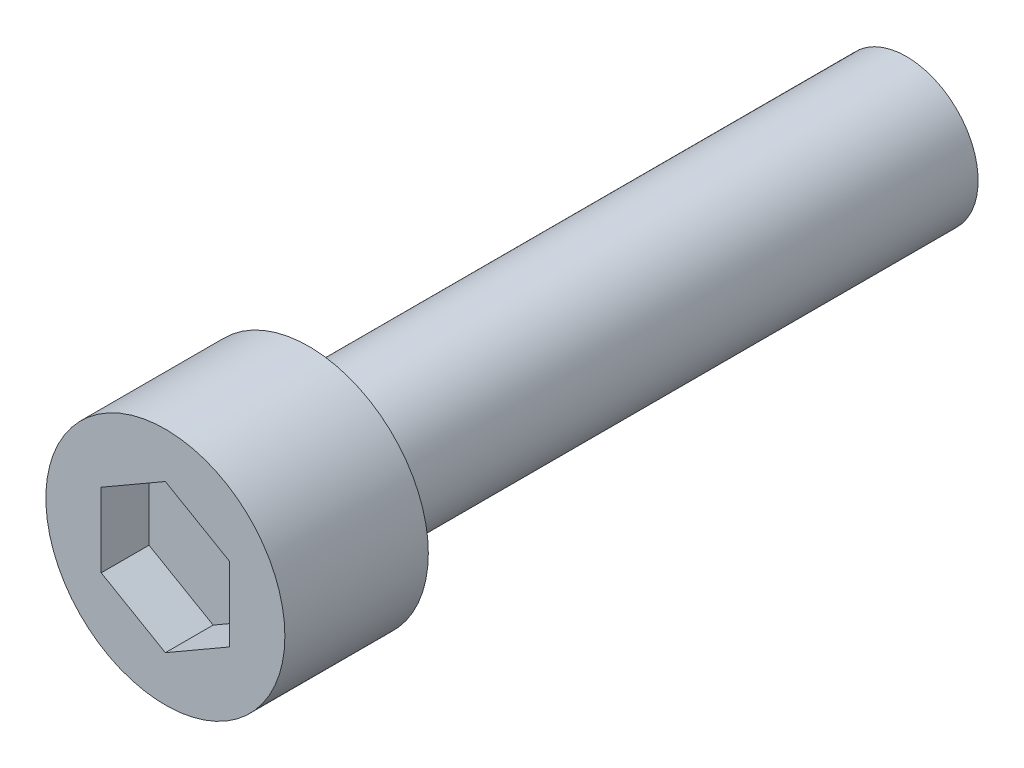
ISO-10303-21;
HEADER;
FILE_DESCRIPTION(('STEP AP214'),'2;1');
FILE_NAME('part.step','',(''),(''),'','','');
FILE_SCHEMA(('AUTOMOTIVE_DESIGN { 1 0 10303 214 1 1 1 1 }'));
ENDSEC;
DATA;
#1=APPLICATION_CONTEXT('core data for automotive mechanical design processes');
#2=APPLICATION_PROTOCOL_DEFINITION('international standard','automotive_design',2000,#1);
#3=PRODUCT_CONTEXT('',#1,'mechanical');
#4=PRODUCT('Part','Part','',(#3));
#5=PRODUCT_RELATED_PRODUCT_CATEGORY('part','',(#4));
#6=PRODUCT_DEFINITION_FORMATION('','',#4);
#7=PRODUCT_DEFINITION_CONTEXT('part definition',#1,'design');
#8=PRODUCT_DEFINITION('design','',#6,#7);
#9=PRODUCT_DEFINITION_SHAPE('','',#8);
#10=(LENGTH_UNIT() NAMED_UNIT(*) SI_UNIT(.MILLI.,.METRE.));
#11=(NAMED_UNIT(*) PLANE_ANGLE_UNIT() SI_UNIT($,.RADIAN.));
#12=(NAMED_UNIT(*) SI_UNIT($,.STERADIAN.) SOLID_ANGLE_UNIT());
#13=UNCERTAINTY_MEASURE_WITH_UNIT(LENGTH_MEASURE(1.E-05),#10,'distance_accuracy_value','');
#14=(GEOMETRIC_REPRESENTATION_CONTEXT(3) GLOBAL_UNCERTAINTY_ASSIGNED_CONTEXT((#13)) GLOBAL_UNIT_ASSIGNED_CONTEXT((#10,
#11,#12)) REPRESENTATION_CONTEXT('',''));
#15=CARTESIAN_POINT('',(0.,0.,0.));
#16=DIRECTION('',(0.,0.,1.));
#17=DIRECTION('',(1.,0.,0.));
#18=AXIS2_PLACEMENT_3D('',#15,#16,#17);
#19=CARTESIAN_POINT('',(0.,0.,4.));
#20=DIRECTION('',(0.,0.,1.));
#21=DIRECTION('',(1.,0.,0.));
#22=AXIS2_PLACEMENT_3D('',#19,#20,#21);
#23=PLANE('',#22);
#24=DIRECTION('',(0.866025403784439,0.5,0.));
#25=VECTOR('',#24,1.);
#26=CARTESIAN_POINT('',(2.68516980116154,-1.55028350752047,4.));
#27=LINE('',#26,#25);
#28=CARTESIAN_POINT('',(0.,-3.10056701504094,4.));
#29=VERTEX_POINT('',#28);
#30=CARTESIAN_POINT('',(2.68516980116154,-1.55028350752047,4.));
#31=VERTEX_POINT('',#30);
#32=EDGE_CURVE('E135',#29,#31,#27,.T.);
#33=ORIENTED_EDGE('',*,*,#32,.T.);
#34=DIRECTION('',(0.,1.,0.));
#35=VECTOR('',#34,1.);
#36=CARTESIAN_POINT('',(2.68516980116154,1.55028350752047,4.));
#37=LINE('',#36,#35);
#38=CARTESIAN_POINT('',(2.68516980116154,1.55028350752047,4.));
#39=VERTEX_POINT('',#38);
#40=EDGE_CURVE('E67',#31,#39,#37,.T.);
#41=ORIENTED_EDGE('',*,*,#40,.T.);
#42=DIRECTION('',(-0.866025403784439,0.5,0.));
#43=VECTOR('',#42,1.);
#44=CARTESIAN_POINT('',(0.,3.10056701504094,4.));
#45=LINE('',#44,#43);
#46=CARTESIAN_POINT('',(0.,3.10056701504094,4.));
#47=VERTEX_POINT('',#46);
#48=EDGE_CURVE('E69',#39,#47,#45,.T.);
#49=ORIENTED_EDGE('',*,*,#48,.T.);
#50=DIRECTION('',(-0.866025403784439,-0.5,0.));
#51=VECTOR('',#50,1.);
#52=CARTESIAN_POINT('',(-2.68516980116154,1.55028350752047,4.));
#53=LINE('',#52,#51);
#54=CARTESIAN_POINT('',(-2.68516980116154,1.55028350752047,4.));
#55=VERTEX_POINT('',#54);
#56=EDGE_CURVE('E71',#47,#55,#53,.T.);
#57=ORIENTED_EDGE('',*,*,#56,.T.);
#58=DIRECTION('',(0.,-1.,0.));
#59=VECTOR('',#58,1.);
#60=CARTESIAN_POINT('',(-2.68516980116154,-1.55028350752047,4.));
#61=LINE('',#60,#59);
#62=CARTESIAN_POINT('',(-2.68516980116154,-1.55028350752047,4.));
#63=VERTEX_POINT('',#62);
#64=EDGE_CURVE('E126',#55,#63,#61,.T.);
#65=ORIENTED_EDGE('',*,*,#64,.T.);
#66=DIRECTION('',(0.866025403784439,-0.5,0.));
#67=VECTOR('',#66,1.);
#68=CARTESIAN_POINT('',(0.,-3.10056701504094,4.));
#69=LINE('',#68,#67);
#70=EDGE_CURVE('E131',#63,#29,#69,.T.);
#71=ORIENTED_EDGE('',*,*,#70,.T.);
#72=EDGE_LOOP('',(#33,#41,#49,#57,#65,#71));
#73=FACE_BOUND('',#72,.T.);
#74=ADVANCED_FACE('F16',(#73),#23,.T.);
#75=CARTESIAN_POINT('',(-2.68516980116154,1.55028350752047,6.));
#76=DIRECTION('',(-0.5,0.866025403784439,0.));
#77=DIRECTION('',(-0.866025403784439,-0.5,0.));
#78=AXIS2_PLACEMENT_3D('',#75,#76,#77);
#79=PLANE('',#78);
#80=DIRECTION('',(0.,0.,1.));
#81=VECTOR('',#80,1.);
#82=CARTESIAN_POINT('',(-2.68516980116154,1.55028350752047,6.));
#83=LINE('',#82,#81);
#84=CARTESIAN_POINT('',(-2.68516980116154,1.55028350752047,6.));
#85=VERTEX_POINT('',#84);
#86=EDGE_CURVE('E82',#85,#55,#83,.F.);
#87=ORIENTED_EDGE('',*,*,#86,.T.);
#88=ORIENTED_EDGE('',*,*,#56,.F.);
#89=DIRECTION('',(0.,0.,1.));
#90=VECTOR('',#89,1.);
#91=CARTESIAN_POINT('',(0.,3.10056701504094,6.));
#92=LINE('',#91,#90);
#93=CARTESIAN_POINT('',(0.,3.10056701504094,6.));
#94=VERTEX_POINT('',#93);
#95=EDGE_CURVE('E76',#47,#94,#92,.T.);
#96=ORIENTED_EDGE('',*,*,#95,.T.);
#97=DIRECTION('',(0.866025403784438,0.5,0.));
#98=VECTOR('',#97,1.);
#99=CARTESIAN_POINT('',(-2.68516980116154,1.55028350752047,6.));
#100=LINE('',#99,#98);
#101=EDGE_CURVE('E123',#85,#94,#100,.T.);
#102=ORIENTED_EDGE('',*,*,#101,.F.);
#103=EDGE_LOOP('',(#87,#88,#96,#102));
#104=FACE_BOUND('',#103,.T.);
#105=ADVANCED_FACE('F79',(#104),#79,.F.);
#106=CARTESIAN_POINT('',(0.,3.10056701504094,6.));
#107=DIRECTION('',(0.5,0.866025403784439,0.));
#108=DIRECTION('',(-0.866025403784439,0.5,0.));
#109=AXIS2_PLACEMENT_3D('',#106,#107,#108);
#110=PLANE('',#109);
#111=ORIENTED_EDGE('',*,*,#95,.F.);
#112=ORIENTED_EDGE('',*,*,#48,.F.);
#113=DIRECTION('',(0.,0.,-1.));
#114=VECTOR('',#113,1.);
#115=CARTESIAN_POINT('',(2.68516980116154,1.55028350752047,6.));
#116=LINE('',#115,#114);
#117=CARTESIAN_POINT('',(2.68516980116154,1.55028350752047,6.));
#118=VERTEX_POINT('',#117);
#119=EDGE_CURVE('E90',#39,#118,#116,.F.);
#120=ORIENTED_EDGE('',*,*,#119,.T.);
#121=DIRECTION('',(0.866025403784438,-0.5,0.));
#122=VECTOR('',#121,1.);
#123=CARTESIAN_POINT('',(0.,3.10056701504094,6.));
#124=LINE('',#123,#122);
#125=EDGE_CURVE('E87',#94,#118,#124,.T.);
#126=ORIENTED_EDGE('',*,*,#125,.F.);
#127=EDGE_LOOP('',(#111,#112,#120,#126));
#128=FACE_BOUND('',#127,.T.);
#129=ADVANCED_FACE('F85',(#128),#110,.F.);
#130=CARTESIAN_POINT('',(2.68516980116154,1.55028350752047,6.));
#131=DIRECTION('',(1.,0.,0.));
#132=DIRECTION('',(0.,0.,-1.));
#133=AXIS2_PLACEMENT_3D('',#130,#131,#132);
#134=PLANE('',#133);
#135=ORIENTED_EDGE('',*,*,#119,.F.);
#136=ORIENTED_EDGE('',*,*,#40,.F.);
#137=DIRECTION('',(0.,0.,1.));
#138=VECTOR('',#137,1.);
#139=CARTESIAN_POINT('',(2.68516980116154,-1.55028350752047,6.));
#140=LINE('',#139,#138);
#141=CARTESIAN_POINT('',(2.68516980116154,-1.55028350752047,6.));
#142=VERTEX_POINT('',#141);
#143=EDGE_CURVE('E133',#31,#142,#140,.T.);
#144=ORIENTED_EDGE('',*,*,#143,.T.);
#145=DIRECTION('',(0.,1.,0.));
#146=VECTOR('',#145,1.);
#147=CARTESIAN_POINT('',(2.68516980116154,0.,6.));
#148=LINE('',#147,#146);
#149=EDGE_CURVE('E119',#118,#142,#148,.F.);
#150=ORIENTED_EDGE('',*,*,#149,.F.);
#151=EDGE_LOOP('',(#135,#136,#144,#150));
#152=FACE_BOUND('',#151,.T.);
#153=ADVANCED_FACE('F138',(#152),#134,.F.);
#154=CARTESIAN_POINT('',(2.68516980116154,-1.55028350752047,6.));
#155=DIRECTION('',(0.5,-0.866025403784439,0.));
#156=DIRECTION('',(0.866025403784439,0.5,0.));
#157=AXIS2_PLACEMENT_3D('',#154,#155,#156);
#158=PLANE('',#157);
#159=ORIENTED_EDGE('',*,*,#143,.F.);
#160=ORIENTED_EDGE('',*,*,#32,.F.);
#161=DIRECTION('',(0.,0.,1.));
#162=VECTOR('',#161,1.);
#163=CARTESIAN_POINT('',(0.,-3.10056701504094,6.));
#164=LINE('',#163,#162);
#165=CARTESIAN_POINT('',(0.,-3.10056701504094,6.));
#166=VERTEX_POINT('',#165);
#167=EDGE_CURVE('E129',#29,#166,#164,.T.);
#168=ORIENTED_EDGE('',*,*,#167,.T.);
#169=DIRECTION('',(-0.866025403784438,-0.5,0.));
#170=VECTOR('',#169,1.);
#171=CARTESIAN_POINT('',(2.68516980116154,-1.55028350752047,6.));
#172=LINE('',#171,#170);
#173=EDGE_CURVE('E114',#142,#166,#172,.T.);
#174=ORIENTED_EDGE('',*,*,#173,.F.);
#175=EDGE_LOOP('',(#159,#160,#168,#174));
#176=FACE_BOUND('',#175,.T.);
#177=ADVANCED_FACE('F149',(#176),#158,.F.);
#178=CARTESIAN_POINT('',(0.,-3.10056701504094,6.));
#179=DIRECTION('',(-0.5,-0.866025403784439,0.));
#180=DIRECTION('',(0.866025403784439,-0.5,0.));
#181=AXIS2_PLACEMENT_3D('',#178,#179,#180);
#182=PLANE('',#181);
#183=ORIENTED_EDGE('',*,*,#167,.F.);
#184=ORIENTED_EDGE('',*,*,#70,.F.);
#185=DIRECTION('',(0.,0.,1.));
#186=VECTOR('',#185,1.);
#187=CARTESIAN_POINT('',(-2.68516980116154,-1.55028350752047,6.));
#188=LINE('',#187,#186);
#189=CARTESIAN_POINT('',(-2.68516980116154,-1.55028350752047,6.));
#190=VERTEX_POINT('',#189);
#191=EDGE_CURVE('E34',#63,#190,#188,.T.);
#192=ORIENTED_EDGE('',*,*,#191,.T.);
#193=DIRECTION('',(-0.866025403784438,0.5,0.));
#194=VECTOR('',#193,1.);
#195=CARTESIAN_POINT('',(0.,-3.10056701504094,6.));
#196=LINE('',#195,#194);
#197=EDGE_CURVE('E110',#166,#190,#196,.T.);
#198=ORIENTED_EDGE('',*,*,#197,.F.);
#199=EDGE_LOOP('',(#183,#184,#192,#198));
#200=FACE_BOUND('',#199,.T.);
#201=ADVANCED_FACE('F147',(#200),#182,.F.);
#202=CARTESIAN_POINT('',(-2.68516980116154,-1.55028350752047,6.));
#203=DIRECTION('',(-1.,0.,0.));
#204=DIRECTION('',(0.,-1.,0.));
#205=AXIS2_PLACEMENT_3D('',#202,#203,#204);
#206=PLANE('',#205);
#207=ORIENTED_EDGE('',*,*,#191,.F.);
#208=ORIENTED_EDGE('',*,*,#64,.F.);
#209=ORIENTED_EDGE('',*,*,#86,.F.);
#210=DIRECTION('',(0.,1.,0.));
#211=VECTOR('',#210,1.);
#212=CARTESIAN_POINT('',(-2.68516980116154,0.,6.));
#213=LINE('',#212,#211);
#214=EDGE_CURVE('E106',#190,#85,#213,.T.);
#215=ORIENTED_EDGE('',*,*,#214,.F.);
#216=EDGE_LOOP('',(#207,#208,#209,#215));
#217=FACE_BOUND('',#216,.T.);
#218=ADVANCED_FACE('F144',(#217),#206,.F.);
#219=CARTESIAN_POINT('',(0.,0.,6.));
#220=DIRECTION('',(0.,0.,1.));
#221=DIRECTION('',(1.,0.,0.));
#222=AXIS2_PLACEMENT_3D('',#219,#220,#221);
#223=PLANE('',#222);
#224=ORIENTED_EDGE('',*,*,#197,.T.);
#225=ORIENTED_EDGE('',*,*,#214,.T.);
#226=ORIENTED_EDGE('',*,*,#101,.T.);
#227=ORIENTED_EDGE('',*,*,#125,.T.);
#228=ORIENTED_EDGE('',*,*,#149,.T.);
#229=ORIENTED_EDGE('',*,*,#173,.T.);
#230=EDGE_LOOP('',(#224,#225,#226,#227,#228,#229));
#231=FACE_BOUND('',#230,.T.);
#232=CARTESIAN_POINT('',(0.,0.,6.));
#233=DIRECTION('',(0.,0.,1.));
#234=DIRECTION('',(1.,0.,0.));
#235=AXIS2_PLACEMENT_3D('',#232,#233,#234);
#236=CIRCLE('',#235,5.);
#237=CARTESIAN_POINT('',(5.,0.,6.));
#238=VERTEX_POINT('',#237);
#239=EDGE_CURVE('E103',#238,#238,#236,.F.);
#240=ORIENTED_EDGE('',*,*,#239,.F.);
#241=EDGE_LOOP('',(#240));
#242=FACE_BOUND('',#241,.T.);
#243=ADVANCED_FACE('F141',(#231,#242),#223,.T.);
#244=CARTESIAN_POINT('',(0.,0.,0.));
#245=DIRECTION('',(0.,0.,1.));
#246=DIRECTION('',(1.,0.,0.));
#247=AXIS2_PLACEMENT_3D('',#244,#245,#246);
#248=CYLINDRICAL_SURFACE('',#247,5.);
#249=CARTESIAN_POINT('',(0.,0.,0.));
#250=DIRECTION('',(0.,0.,1.));
#251=DIRECTION('',(1.,0.,0.));
#252=AXIS2_PLACEMENT_3D('',#249,#250,#251);
#253=CIRCLE('',#252,5.);
#254=CARTESIAN_POINT('',(5.,0.,0.));
#255=VERTEX_POINT('',#254);
#256=EDGE_CURVE('E98',#255,#255,#253,.T.);
#257=ORIENTED_EDGE('',*,*,#256,.T.);
#258=EDGE_LOOP('',(#257));
#259=FACE_BOUND('',#258,.T.);
#260=ORIENTED_EDGE('',*,*,#239,.T.);
#261=EDGE_LOOP('',(#260));
#262=FACE_BOUND('',#261,.T.);
#263=ADVANCED_FACE('F174',(#259,#262),#248,.T.);
#264=CARTESIAN_POINT('',(0.,0.,-25.));
#265=DIRECTION('',(0.,0.,1.));
#266=DIRECTION('',(1.,0.,0.));
#267=AXIS2_PLACEMENT_3D('',#264,#265,#266);
#268=PLANE('',#267);
#269=CARTESIAN_POINT('',(0.,0.,-25.));
#270=DIRECTION('',(0.,0.,-1.));
#271=DIRECTION('',(-1.,0.,0.));
#272=AXIS2_PLACEMENT_3D('',#269,#270,#271);
#273=CIRCLE('',#272,3.);
#274=CARTESIAN_POINT('',(-3.,0.,-25.));
#275=VERTEX_POINT('',#274);
#276=EDGE_CURVE('E25',#275,#275,#273,.F.);
#277=ORIENTED_EDGE('',*,*,#276,.F.);
#278=EDGE_LOOP('',(#277));
#279=FACE_BOUND('',#278,.T.);
#280=ADVANCED_FACE('F167',(#279),#268,.F.);
#281=CARTESIAN_POINT('',(0.,0.,0.));
#282=DIRECTION('',(0.,0.,1.));
#283=DIRECTION('',(1.,0.,0.));
#284=AXIS2_PLACEMENT_3D('',#281,#282,#283);
#285=PLANE('',#284);
#286=CARTESIAN_POINT('',(0.,0.,0.));
#287=DIRECTION('',(0.,0.,-1.));
#288=DIRECTION('',(-1.,0.,0.));
#289=AXIS2_PLACEMENT_3D('',#286,#287,#288);
#290=CIRCLE('',#289,3.);
#291=CARTESIAN_POINT('',(-3.,0.,0.));
#292=VERTEX_POINT('',#291);
#293=EDGE_CURVE('E11',#292,#292,#290,.T.);
#294=ORIENTED_EDGE('',*,*,#293,.F.);
#295=EDGE_LOOP('',(#294));
#296=FACE_BOUND('',#295,.T.);
#297=ORIENTED_EDGE('',*,*,#256,.F.);
#298=EDGE_LOOP('',(#297));
#299=FACE_BOUND('',#298,.T.);
#300=ADVANCED_FACE('F161',(#296,#299),#285,.F.);
#301=CARTESIAN_POINT('',(0.,0.,0.));
#302=DIRECTION('',(0.,0.,-1.));
#303=DIRECTION('',(-1.,0.,0.));
#304=AXIS2_PLACEMENT_3D('',#301,#302,#303);
#305=CYLINDRICAL_SURFACE('',#304,3.);
#306=ORIENTED_EDGE('',*,*,#293,.T.);
#307=EDGE_LOOP('',(#306));
#308=FACE_BOUND('',#307,.T.);
#309=ORIENTED_EDGE('',*,*,#276,.T.);
#310=EDGE_LOOP('',(#309));
#311=FACE_BOUND('',#310,.T.);
#312=ADVANCED_FACE('F159',(#308,#311),#305,.T.);
#313=CLOSED_SHELL('',(#74,#105,#129,#153,#177,#201,#218,#243,#263,#280,#300,#312));
#314=MANIFOLD_SOLID_BREP('B1',#313);
#315=ADVANCED_BREP_SHAPE_REPRESENTATION('',(#18,#314),#14);
#316=SHAPE_DEFINITION_REPRESENTATION(#9,#315);
ENDSEC;
END-ISO-10303-21;
